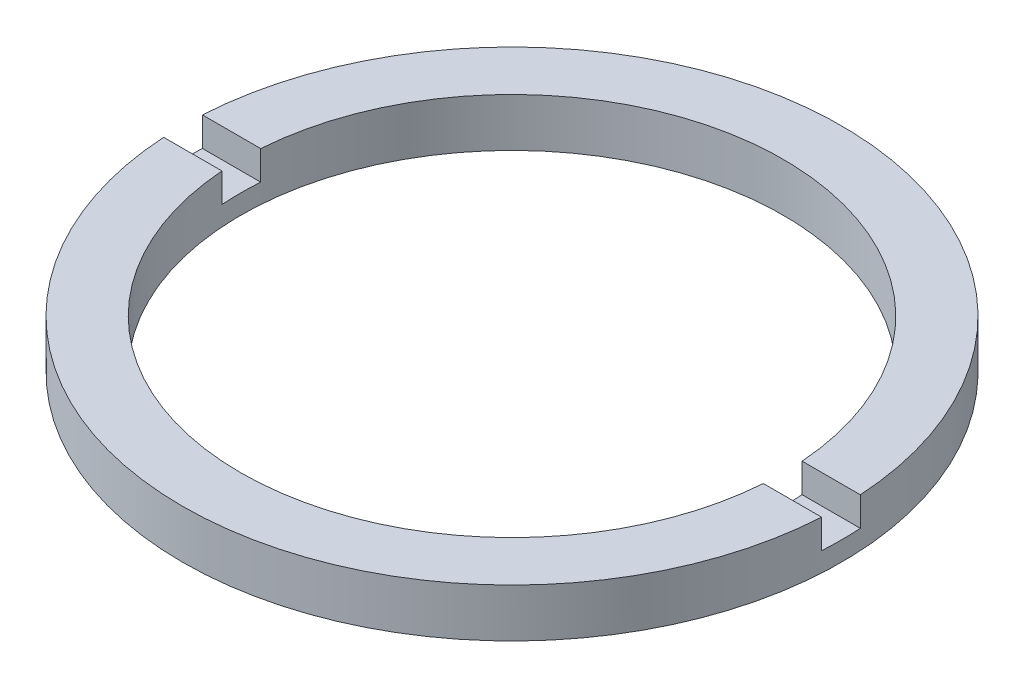
ISO-10303-21;
HEADER;
FILE_DESCRIPTION(('STEP AP214'),'2;1');
FILE_NAME('part.step','',(''),(''),'','','');
FILE_SCHEMA(('AUTOMOTIVE_DESIGN { 1 0 10303 214 1 1 1 1 }'));
ENDSEC;
DATA;
#1=APPLICATION_CONTEXT('core data for automotive mechanical design processes');
#2=APPLICATION_PROTOCOL_DEFINITION('international standard','automotive_design',2000,#1);
#3=PRODUCT_CONTEXT('',#1,'mechanical');
#4=PRODUCT('Part','Part','',(#3));
#5=PRODUCT_RELATED_PRODUCT_CATEGORY('part','',(#4));
#6=PRODUCT_DEFINITION_FORMATION('','',#4);
#7=PRODUCT_DEFINITION_CONTEXT('part definition',#1,'design');
#8=PRODUCT_DEFINITION('design','',#6,#7);
#9=PRODUCT_DEFINITION_SHAPE('','',#8);
#10=(LENGTH_UNIT() NAMED_UNIT(*) SI_UNIT(.MILLI.,.METRE.));
#11=(NAMED_UNIT(*) PLANE_ANGLE_UNIT() SI_UNIT($,.RADIAN.));
#12=(NAMED_UNIT(*) SI_UNIT($,.STERADIAN.) SOLID_ANGLE_UNIT());
#13=UNCERTAINTY_MEASURE_WITH_UNIT(LENGTH_MEASURE(1.E-05),#10,'distance_accuracy_value','');
#14=(GEOMETRIC_REPRESENTATION_CONTEXT(3) GLOBAL_UNCERTAINTY_ASSIGNED_CONTEXT((#13)) GLOBAL_UNIT_ASSIGNED_CONTEXT((#10,
#11,#12)) REPRESENTATION_CONTEXT('',''));
#15=CARTESIAN_POINT('',(0.,0.,0.));
#16=DIRECTION('',(0.,0.,1.));
#17=DIRECTION('',(1.,0.,0.));
#18=AXIS2_PLACEMENT_3D('',#15,#16,#17);
#19=CARTESIAN_POINT('',(14.,-1.96424978717943,0.));
#20=DIRECTION('',(0.,-1.,0.));
#21=DIRECTION('',(0.,0.,-1.));
#22=AXIS2_PLACEMENT_3D('',#19,#20,#21);
#23=PLANE('',#22);
#24=CARTESIAN_POINT('',(0.,-1.96424978717943,0.));
#25=DIRECTION('',(0.,1.,0.));
#26=DIRECTION('',(0.,0.,1.));
#27=AXIS2_PLACEMENT_3D('',#24,#25,#26);
#28=CIRCLE('',#27,17.);
#29=CARTESIAN_POINT('',(-16.9705627484772,-1.96424978717943,1.));
#30=VERTEX_POINT('',#29);
#31=CARTESIAN_POINT('',(16.9705627484771,-1.96424978717943,1.));
#32=VERTEX_POINT('',#31);
#33=EDGE_CURVE('E126',#30,#32,#28,.T.);
#34=ORIENTED_EDGE('',*,*,#33,.T.);
#35=DIRECTION('',(1.,0.,0.));
#36=VECTOR('',#35,1.);
#37=CARTESIAN_POINT('',(-26.8525402726146,-1.96424978717943,1.));
#38=LINE('',#37,#36);
#39=CARTESIAN_POINT('',(13.9642400437689,-1.96424978717943,1.));
#40=VERTEX_POINT('',#39);
#41=EDGE_CURVE('E119',#40,#32,#38,.T.);
#42=ORIENTED_EDGE('',*,*,#41,.F.);
#43=CARTESIAN_POINT('',(0.,-1.96424978717943,0.));
#44=DIRECTION('',(0.,1.,0.));
#45=DIRECTION('',(0.,0.,1.));
#46=AXIS2_PLACEMENT_3D('',#43,#44,#45);
#47=CIRCLE('',#46,14.);
#48=CARTESIAN_POINT('',(-13.9642400437689,-1.96424978717943,1.));
#49=VERTEX_POINT('',#48);
#50=EDGE_CURVE('E133',#49,#40,#47,.T.);
#51=ORIENTED_EDGE('',*,*,#50,.F.);
#52=EDGE_CURVE('E148',#30,#49,#38,.T.);
#53=ORIENTED_EDGE('',*,*,#52,.F.);
#54=EDGE_LOOP('',(#34,#42,#51,#53));
#55=FACE_BOUND('',#54,.T.);
#56=ADVANCED_FACE('F36',(#55),#23,.F.);
#57=CARTESIAN_POINT('',(0.,56.2608426270136,0.));
#58=DIRECTION('',(0.,1.,0.));
#59=DIRECTION('',(0.,0.,1.));
#60=AXIS2_PLACEMENT_3D('',#57,#58,#59);
#61=CYLINDRICAL_SURFACE('',#60,17.);
#62=CARTESIAN_POINT('',(0.,-3.46424978717943,0.));
#63=DIRECTION('',(0.,1.,0.));
#64=DIRECTION('',(0.,0.,1.));
#65=AXIS2_PLACEMENT_3D('',#62,#63,#64);
#66=CIRCLE('',#65,17.);
#67=CARTESIAN_POINT('',(16.9705627484771,-3.46424978717943,1.));
#68=VERTEX_POINT('',#67);
#69=CARTESIAN_POINT('',(16.9705627484771,-3.46424978717943,-1.));
#70=VERTEX_POINT('',#69);
#71=EDGE_CURVE('E109',#68,#70,#66,.T.);
#72=ORIENTED_EDGE('',*,*,#71,.F.);
#73=DIRECTION('',(0.,1.,0.));
#74=VECTOR('',#73,1.);
#75=CARTESIAN_POINT('',(16.9705627484771,56.2608426270136,1.));
#76=LINE('',#75,#74);
#77=EDGE_CURVE('E161',#68,#32,#76,.T.);
#78=ORIENTED_EDGE('',*,*,#77,.T.);
#79=ORIENTED_EDGE('',*,*,#33,.F.);
#80=DIRECTION('',(0.,1.,0.));
#81=VECTOR('',#80,1.);
#82=CARTESIAN_POINT('',(-16.9705627484771,56.2608426270136,1.));
#83=LINE('',#82,#81);
#84=CARTESIAN_POINT('',(-16.9705627484771,-3.46424978717943,1.));
#85=VERTEX_POINT('',#84);
#86=EDGE_CURVE('E158',#30,#85,#83,.F.);
#87=ORIENTED_EDGE('',*,*,#86,.T.);
#88=CARTESIAN_POINT('',(-16.9705627484771,-3.46424978717943,-1.));
#89=VERTEX_POINT('',#88);
#90=EDGE_CURVE('E155',#89,#85,#66,.T.);
#91=ORIENTED_EDGE('',*,*,#90,.F.);
#92=DIRECTION('',(0.,1.,0.));
#93=VECTOR('',#92,1.);
#94=CARTESIAN_POINT('',(-16.9705627484771,56.2608426270136,-1.));
#95=LINE('',#94,#93);
#96=CARTESIAN_POINT('',(-16.9705627484772,-1.96424978717943,-1.));
#97=VERTEX_POINT('',#96);
#98=EDGE_CURVE('E108',#89,#97,#95,.T.);
#99=ORIENTED_EDGE('',*,*,#98,.T.);
#100=CARTESIAN_POINT('',(16.9705627484771,-1.96424978717943,-1.));
#101=VERTEX_POINT('',#100);
#102=EDGE_CURVE('E116',#101,#97,#28,.T.);
#103=ORIENTED_EDGE('',*,*,#102,.F.);
#104=DIRECTION('',(0.,1.,0.));
#105=VECTOR('',#104,1.);
#106=CARTESIAN_POINT('',(16.9705627484771,56.2608426270136,-1.));
#107=LINE('',#106,#105);
#108=EDGE_CURVE('E100',#101,#70,#107,.F.);
#109=ORIENTED_EDGE('',*,*,#108,.T.);
#110=EDGE_LOOP('',(#72,#78,#79,#87,#91,#99,#103,#109));
#111=FACE_BOUND('',#110,.T.);
#112=CARTESIAN_POINT('',(0.,-4.46424978717943,0.));
#113=DIRECTION('',(0.,1.,0.));
#114=DIRECTION('',(0.,0.,1.));
#115=AXIS2_PLACEMENT_3D('',#112,#113,#114);
#116=CIRCLE('',#115,17.);
#117=CARTESIAN_POINT('',(0.,-4.46424978717943,17.));
#118=VERTEX_POINT('',#117);
#119=EDGE_CURVE('E164',#118,#118,#116,.T.);
#120=ORIENTED_EDGE('',*,*,#119,.T.);
#121=EDGE_LOOP('',(#120));
#122=FACE_BOUND('',#121,.T.);
#123=ADVANCED_FACE('F38',(#111,#122),#61,.T.);
#124=ORIENTED_EDGE('',*,*,#102,.T.);
#125=DIRECTION('',(-1.,0.,0.));
#126=VECTOR('',#125,1.);
#127=CARTESIAN_POINT('',(-26.8525402726146,-1.96424978717943,-1.));
#128=LINE('',#127,#126);
#129=CARTESIAN_POINT('',(-13.9642400437689,-1.96424978717943,-1.));
#130=VERTEX_POINT('',#129);
#131=EDGE_CURVE('E120',#130,#97,#128,.T.);
#132=ORIENTED_EDGE('',*,*,#131,.F.);
#133=CARTESIAN_POINT('',(13.9642400437689,-1.96424978717943,-1.));
#134=VERTEX_POINT('',#133);
#135=EDGE_CURVE('E118',#134,#130,#47,.T.);
#136=ORIENTED_EDGE('',*,*,#135,.F.);
#137=EDGE_CURVE('E103',#101,#134,#128,.T.);
#138=ORIENTED_EDGE('',*,*,#137,.F.);
#139=EDGE_LOOP('',(#124,#132,#136,#138));
#140=FACE_BOUND('',#139,.T.);
#141=ADVANCED_FACE('F114',(#140),#23,.F.);
#142=CARTESIAN_POINT('',(0.,56.2608426270136,0.));
#143=DIRECTION('',(0.,1.,0.));
#144=DIRECTION('',(0.,0.,1.));
#145=AXIS2_PLACEMENT_3D('',#142,#143,#144);
#146=CYLINDRICAL_SURFACE('',#145,14.);
#147=CARTESIAN_POINT('',(0.,-3.46424978717943,0.));
#148=DIRECTION('',(0.,1.,0.));
#149=DIRECTION('',(0.,0.,1.));
#150=AXIS2_PLACEMENT_3D('',#147,#148,#149);
#151=CIRCLE('',#150,14.);
#152=CARTESIAN_POINT('',(-13.9642400437689,-3.46424978717943,1.));
#153=VERTEX_POINT('',#152);
#154=CARTESIAN_POINT('',(-13.9642400437689,-3.46424978717943,-1.));
#155=VERTEX_POINT('',#154);
#156=EDGE_CURVE('E130',#153,#155,#151,.F.);
#157=ORIENTED_EDGE('',*,*,#156,.F.);
#158=DIRECTION('',(0.,1.,0.));
#159=VECTOR('',#158,1.);
#160=CARTESIAN_POINT('',(-13.9642400437689,56.2608426270136,1.));
#161=LINE('',#160,#159);
#162=EDGE_CURVE('E11',#153,#49,#161,.T.);
#163=ORIENTED_EDGE('',*,*,#162,.T.);
#164=ORIENTED_EDGE('',*,*,#50,.T.);
#165=DIRECTION('',(0.,1.,0.));
#166=VECTOR('',#165,1.);
#167=CARTESIAN_POINT('',(13.9642400437689,56.2608426270136,1.));
#168=LINE('',#167,#166);
#169=CARTESIAN_POINT('',(13.9642400437689,-3.46424978717943,1.));
#170=VERTEX_POINT('',#169);
#171=EDGE_CURVE('E137',#40,#170,#168,.F.);
#172=ORIENTED_EDGE('',*,*,#171,.T.);
#173=CARTESIAN_POINT('',(13.9642400437689,-3.46424978717943,-1.));
#174=VERTEX_POINT('',#173);
#175=EDGE_CURVE('E125',#174,#170,#151,.F.);
#176=ORIENTED_EDGE('',*,*,#175,.F.);
#177=DIRECTION('',(0.,1.,0.));
#178=VECTOR('',#177,1.);
#179=CARTESIAN_POINT('',(13.9642400437689,56.2608426270136,-1.));
#180=LINE('',#179,#178);
#181=EDGE_CURVE('E128',#174,#134,#180,.T.);
#182=ORIENTED_EDGE('',*,*,#181,.T.);
#183=ORIENTED_EDGE('',*,*,#135,.T.);
#184=DIRECTION('',(0.,1.,0.));
#185=VECTOR('',#184,1.);
#186=CARTESIAN_POINT('',(-13.9642400437689,56.2608426270136,-1.));
#187=LINE('',#186,#185);
#188=EDGE_CURVE('E44',#130,#155,#187,.F.);
#189=ORIENTED_EDGE('',*,*,#188,.T.);
#190=EDGE_LOOP('',(#157,#163,#164,#172,#176,#182,#183,#189));
#191=FACE_BOUND('',#190,.T.);
#192=CARTESIAN_POINT('',(0.,-4.46424978717943,0.));
#193=DIRECTION('',(0.,1.,0.));
#194=DIRECTION('',(0.,0.,1.));
#195=AXIS2_PLACEMENT_3D('',#192,#193,#194);
#196=CIRCLE('',#195,14.);
#197=CARTESIAN_POINT('',(0.,-4.46424978717943,14.));
#198=VERTEX_POINT('',#197);
#199=EDGE_CURVE('E166',#198,#198,#196,.T.);
#200=ORIENTED_EDGE('',*,*,#199,.F.);
#201=EDGE_LOOP('',(#200));
#202=FACE_BOUND('',#201,.T.);
#203=ADVANCED_FACE('F172',(#191,#202),#146,.F.);
#204=CARTESIAN_POINT('',(14.,-4.46424978717943,0.));
#205=DIRECTION('',(0.,1.,0.));
#206=DIRECTION('',(0.,0.,1.));
#207=AXIS2_PLACEMENT_3D('',#204,#205,#206);
#208=PLANE('',#207);
#209=ORIENTED_EDGE('',*,*,#119,.F.);
#210=EDGE_LOOP('',(#209));
#211=FACE_BOUND('',#210,.T.);
#212=ORIENTED_EDGE('',*,*,#199,.T.);
#213=EDGE_LOOP('',(#212));
#214=FACE_BOUND('',#213,.T.);
#215=ADVANCED_FACE('F202',(#211,#214),#208,.F.);
#216=CARTESIAN_POINT('',(0.,-3.46424978717943,0.));
#217=DIRECTION('',(0.,1.,0.));
#218=DIRECTION('',(0.,0.,1.));
#219=AXIS2_PLACEMENT_3D('',#216,#217,#218);
#220=PLANE('',#219);
#221=ORIENTED_EDGE('',*,*,#71,.T.);
#222=DIRECTION('',(-1.,0.,0.));
#223=VECTOR('',#222,1.);
#224=CARTESIAN_POINT('',(-26.8525402726146,-3.46424978717943,-1.));
#225=LINE('',#224,#223);
#226=EDGE_CURVE('E59',#70,#174,#225,.T.);
#227=ORIENTED_EDGE('',*,*,#226,.T.);
#228=ORIENTED_EDGE('',*,*,#175,.T.);
#229=DIRECTION('',(1.,0.,0.));
#230=VECTOR('',#229,1.);
#231=CARTESIAN_POINT('',(-26.8525402726146,-3.46424978717943,1.));
#232=LINE('',#231,#230);
#233=EDGE_CURVE('E150',#170,#68,#232,.T.);
#234=ORIENTED_EDGE('',*,*,#233,.T.);
#235=EDGE_LOOP('',(#221,#227,#228,#234));
#236=FACE_BOUND('',#235,.T.);
#237=ADVANCED_FACE('F176',(#236),#220,.T.);
#238=CARTESIAN_POINT('',(-26.8525402726146,-3.46424978717943,-1.));
#239=DIRECTION('',(0.,0.,-1.));
#240=DIRECTION('',(-1.,0.,0.));
#241=AXIS2_PLACEMENT_3D('',#238,#239,#240);
#242=PLANE('',#241);
#243=ORIENTED_EDGE('',*,*,#137,.T.);
#244=ORIENTED_EDGE('',*,*,#181,.F.);
#245=ORIENTED_EDGE('',*,*,#226,.F.);
#246=ORIENTED_EDGE('',*,*,#108,.F.);
#247=EDGE_LOOP('',(#243,#244,#245,#246));
#248=FACE_BOUND('',#247,.T.);
#249=ADVANCED_FACE('F102',(#248),#242,.F.);
#250=CARTESIAN_POINT('',(-26.8525402726146,-3.46424978717943,1.));
#251=DIRECTION('',(0.,0.,1.));
#252=DIRECTION('',(1.,0.,0.));
#253=AXIS2_PLACEMENT_3D('',#250,#251,#252);
#254=PLANE('',#253);
#255=ORIENTED_EDGE('',*,*,#233,.F.);
#256=ORIENTED_EDGE('',*,*,#171,.F.);
#257=ORIENTED_EDGE('',*,*,#41,.T.);
#258=ORIENTED_EDGE('',*,*,#77,.F.);
#259=EDGE_LOOP('',(#255,#256,#257,#258));
#260=FACE_BOUND('',#259,.T.);
#261=ADVANCED_FACE('F178',(#260),#254,.F.);
#262=ORIENTED_EDGE('',*,*,#52,.T.);
#263=ORIENTED_EDGE('',*,*,#162,.F.);
#264=EDGE_CURVE('E51',#85,#153,#232,.T.);
#265=ORIENTED_EDGE('',*,*,#264,.F.);
#266=ORIENTED_EDGE('',*,*,#86,.F.);
#267=EDGE_LOOP('',(#262,#263,#265,#266));
#268=FACE_BOUND('',#267,.T.);
#269=ADVANCED_FACE('F184',(#268),#254,.F.);
#270=EDGE_CURVE('E145',#155,#89,#225,.T.);
#271=ORIENTED_EDGE('',*,*,#270,.F.);
#272=ORIENTED_EDGE('',*,*,#188,.F.);
#273=ORIENTED_EDGE('',*,*,#131,.T.);
#274=ORIENTED_EDGE('',*,*,#98,.F.);
#275=EDGE_LOOP('',(#271,#272,#273,#274));
#276=FACE_BOUND('',#275,.T.);
#277=ADVANCED_FACE('F147',(#276),#242,.F.);
#278=ORIENTED_EDGE('',*,*,#90,.T.);
#279=ORIENTED_EDGE('',*,*,#264,.T.);
#280=ORIENTED_EDGE('',*,*,#156,.T.);
#281=ORIENTED_EDGE('',*,*,#270,.T.);
#282=EDGE_LOOP('',(#278,#279,#280,#281));
#283=FACE_BOUND('',#282,.T.);
#284=ADVANCED_FACE('F144',(#283),#220,.T.);
#285=CLOSED_SHELL('',(#56,#123,#141,#203,#215,#237,#249,#261,#269,#277,#284));
#286=MANIFOLD_SOLID_BREP('B2',#285);
#287=ADVANCED_BREP_SHAPE_REPRESENTATION('',(#18,#286),#14);
#288=SHAPE_DEFINITION_REPRESENTATION(#9,#287);
ENDSEC;
END-ISO-10303-21;
